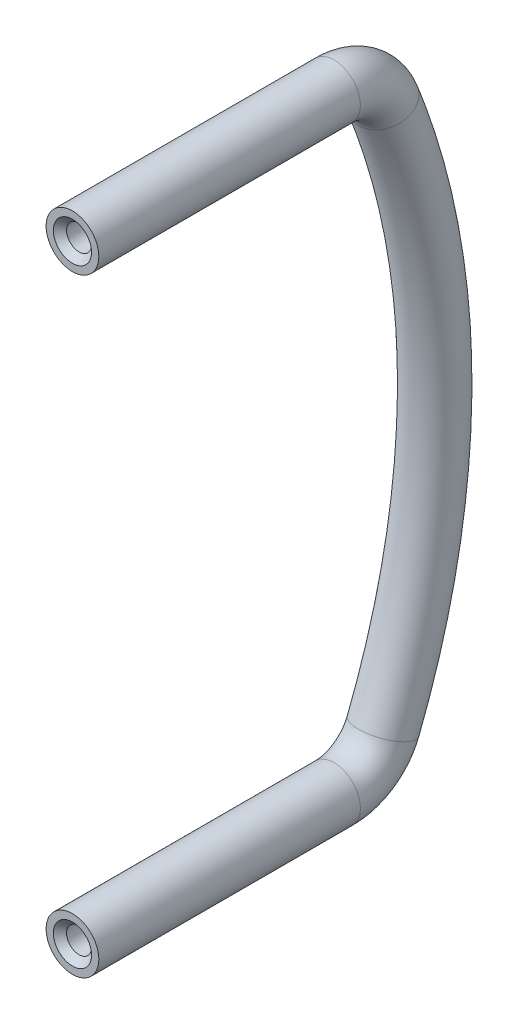
ISO-10303-21;
HEADER;
FILE_DESCRIPTION(('STEP AP214'),'2;1');
FILE_NAME('part.step','',(''),(''),'','','');
FILE_SCHEMA(('AUTOMOTIVE_DESIGN { 1 0 10303 214 1 1 1 1 }'));
ENDSEC;
DATA;
#1=APPLICATION_CONTEXT('core data for automotive mechanical design processes');
#2=APPLICATION_PROTOCOL_DEFINITION('international standard','automotive_design',2000,#1);
#3=PRODUCT_CONTEXT('',#1,'mechanical');
#4=PRODUCT('Part','Part','',(#3));
#5=PRODUCT_RELATED_PRODUCT_CATEGORY('part','',(#4));
#6=PRODUCT_DEFINITION_FORMATION('','',#4);
#7=PRODUCT_DEFINITION_CONTEXT('part definition',#1,'design');
#8=PRODUCT_DEFINITION('design','',#6,#7);
#9=PRODUCT_DEFINITION_SHAPE('','',#8);
#10=(LENGTH_UNIT() NAMED_UNIT(*) SI_UNIT(.MILLI.,.METRE.));
#11=(NAMED_UNIT(*) PLANE_ANGLE_UNIT() SI_UNIT($,.RADIAN.));
#12=(NAMED_UNIT(*) SI_UNIT($,.STERADIAN.) SOLID_ANGLE_UNIT());
#13=UNCERTAINTY_MEASURE_WITH_UNIT(LENGTH_MEASURE(1.E-05),#10,'distance_accuracy_value','');
#14=(GEOMETRIC_REPRESENTATION_CONTEXT(3) GLOBAL_UNCERTAINTY_ASSIGNED_CONTEXT((#13)) GLOBAL_UNIT_ASSIGNED_CONTEXT((#10,
#11,#12)) REPRESENTATION_CONTEXT('',''));
#15=CARTESIAN_POINT('',(0.,0.,0.));
#16=DIRECTION('',(0.,0.,1.));
#17=DIRECTION('',(1.,0.,0.));
#18=AXIS2_PLACEMENT_3D('',#15,#16,#17);
#19=CARTESIAN_POINT('',(0.,-6.3,-78.5780172444106));
#20=DIRECTION('',(0.,0.,1.));
#21=DIRECTION('',(1.,0.,0.));
#22=AXIS2_PLACEMENT_3D('',#19,#20,#21);
#23=CONICAL_SURFACE('',#22,0.94999999976153,1.04719755088572);
#24=CARTESIAN_POINT('',(-2.55795384873636E-10,-6.3,-79.1265000001147));
#25=VERTEX_POINT('',#24);
#26=VERTEX_LOOP('',#25);
#27=FACE_BOUND('',#26,.T.);
#28=CARTESIAN_POINT('',(0.,-6.3,-78.57801724427));
#29=DIRECTION('',(0.,0.,1.));
#30=DIRECTION('',(1.,0.,0.));
#31=AXIS2_PLACEMENT_3D('',#28,#29,#30);
#32=CIRCLE('',#31,0.95);
#33=CARTESIAN_POINT('',(0.95,-6.3,-78.57801724427));
#34=VERTEX_POINT('',#33);
#35=EDGE_CURVE('E37',#34,#34,#32,.T.);
#36=ORIENTED_EDGE('',*,*,#35,.T.);
#37=EDGE_LOOP('',(#36));
#38=FACE_BOUND('',#37,.T.);
#39=ADVANCED_FACE('F17',(#27,#38),#23,.F.);
#40=CARTESIAN_POINT('',(0.,-52.5,-79.1265000000863));
#41=DIRECTION('',(0.,0.,1.));
#42=DIRECTION('',(1.,0.,0.));
#43=AXIS2_PLACEMENT_3D('',#40,#41,#42);
#44=CONICAL_SURFACE('',#43,0.949999999875217,1.04719755089266);
#45=CARTESIAN_POINT('',(0.,-52.5,-79.1265));
#46=DIRECTION('',(0.,0.,1.));
#47=DIRECTION('',(1.,0.,0.));
#48=AXIS2_PLACEMENT_3D('',#45,#46,#47);
#49=CIRCLE('',#48,0.95);
#50=CARTESIAN_POINT('',(0.95,-52.5,-79.1265));
#51=VERTEX_POINT('',#50);
#52=EDGE_CURVE('E39',#51,#51,#49,.T.);
#53=ORIENTED_EDGE('',*,*,#52,.T.);
#54=EDGE_LOOP('',(#53));
#55=FACE_BOUND('',#54,.T.);
#56=CARTESIAN_POINT('',(-2.55795384873636E-10,-52.5,-79.6749827558472));
#57=VERTEX_POINT('',#56);
#58=VERTEX_LOOP('',#57);
#59=FACE_BOUND('',#58,.T.);
#60=ADVANCED_FACE('F34',(#55,#59),#44,.F.);
#61=CARTESIAN_POINT('',(0.,-6.3,-79.4265));
#62=DIRECTION('',(0.,0.,1.));
#63=DIRECTION('',(1.,0.,0.));
#64=AXIS2_PLACEMENT_3D('',#61,#62,#63);
#65=CYLINDRICAL_SURFACE('',#64,0.95);
#66=ORIENTED_EDGE('',*,*,#35,.F.);
#67=EDGE_LOOP('',(#66));
#68=FACE_BOUND('',#67,.T.);
#69=CARTESIAN_POINT('',(0.,-6.3,-73.6265000000458));
#70=DIRECTION('',(0.,0.,1.));
#71=DIRECTION('',(0.,-1.,0.));
#72=AXIS2_PLACEMENT_3D('',#69,#70,#71);
#73=CIRCLE('',#72,0.94999999999909);
#74=CARTESIAN_POINT('',(0.,-7.24999999999909,-73.6265000000458));
#75=VERTEX_POINT('',#74);
#76=EDGE_CURVE('E42',#75,#75,#73,.T.);
#77=ORIENTED_EDGE('',*,*,#76,.T.);
#78=EDGE_LOOP('',(#77));
#79=FACE_BOUND('',#78,.T.);
#80=ADVANCED_FACE('F109',(#68,#79),#65,.F.);
#81=CARTESIAN_POINT('',(0.,-52.5,-80.00240689352));
#82=DIRECTION('',(0.,0.,1.));
#83=DIRECTION('',(1.,0.,0.));
#84=AXIS2_PLACEMENT_3D('',#81,#82,#83);
#85=CYLINDRICAL_SURFACE('',#84,0.95);
#86=ORIENTED_EDGE('',*,*,#52,.F.);
#87=EDGE_LOOP('',(#86));
#88=FACE_BOUND('',#87,.T.);
#89=CARTESIAN_POINT('',(0.,-52.5,-73.6264999999889));
#90=DIRECTION('',(0.,0.,1.));
#91=DIRECTION('',(0.,-1.,0.));
#92=AXIS2_PLACEMENT_3D('',#89,#90,#91);
#93=CIRCLE('',#92,0.949999999998001);
#94=CARTESIAN_POINT('',(0.,-53.449999999998,-73.6264999999889));
#95=VERTEX_POINT('',#94);
#96=EDGE_CURVE('E57',#95,#95,#93,.T.);
#97=ORIENTED_EDGE('',*,*,#96,.T.);
#98=EDGE_LOOP('',(#97));
#99=FACE_BOUND('',#98,.T.);
#100=ADVANCED_FACE('F105',(#88,#99),#85,.F.);
#101=CARTESIAN_POINT('',(0.,-6.3,-73.1265000001144));
#102=DIRECTION('',(0.,0.,1.));
#103=DIRECTION('',(1.,0.,0.));
#104=AXIS2_PLACEMENT_3D('',#101,#102,#103);
#105=CONICAL_SURFACE('',#104,1.44999999993042,0.785398163397448);
#106=ORIENTED_EDGE('',*,*,#76,.F.);
#107=EDGE_LOOP('',(#106));
#108=FACE_BOUND('',#107,.T.);
#109=CARTESIAN_POINT('',(0.,-6.3,-73.1265000000678));
#110=DIRECTION('',(0.,0.,1.));
#111=DIRECTION('',(1.,0.,0.));
#112=AXIS2_PLACEMENT_3D('',#109,#110,#111);
#113=CIRCLE('',#112,1.44999999997708);
#114=CARTESIAN_POINT('',(1.44999999997708,-6.3,-73.1265000000678));
#115=VERTEX_POINT('',#114);
#116=EDGE_CURVE('E20',#115,#115,#113,.F.);
#117=ORIENTED_EDGE('',*,*,#116,.F.);
#118=EDGE_LOOP('',(#117));
#119=FACE_BOUND('',#118,.T.);
#120=ADVANCED_FACE('F101',(#108,#119),#105,.F.);
#121=CARTESIAN_POINT('',(0.,-52.5,-73.1265000000008));
#122=DIRECTION('',(0.,0.,1.));
#123=DIRECTION('',(1.,0.,0.));
#124=AXIS2_PLACEMENT_3D('',#121,#122,#123);
#125=CONICAL_SURFACE('',#124,1.44999999998618,0.785398163397448);
#126=ORIENTED_EDGE('',*,*,#96,.F.);
#127=EDGE_LOOP('',(#126));
#128=FACE_BOUND('',#127,.T.);
#129=CARTESIAN_POINT('',(0.,-52.5,-73.1265000000099));
#130=DIRECTION('',(0.,0.,1.));
#131=DIRECTION('',(1.,0.,0.));
#132=AXIS2_PLACEMENT_3D('',#129,#130,#131);
#133=CIRCLE('',#132,1.44999999997708);
#134=CARTESIAN_POINT('',(1.44999999997708,-52.5,-73.1265000000099));
#135=VERTEX_POINT('',#134);
#136=EDGE_CURVE('E52',#135,#135,#133,.T.);
#137=ORIENTED_EDGE('',*,*,#136,.T.);
#138=EDGE_LOOP('',(#137));
#139=FACE_BOUND('',#138,.T.);
#140=ADVANCED_FACE('F98',(#128,#139),#125,.F.);
#141=CARTESIAN_POINT('',(0.,-6.3,-73.1265));
#142=DIRECTION('',(0.,0.,1.));
#143=DIRECTION('',(1.,0.,0.));
#144=AXIS2_PLACEMENT_3D('',#141,#142,#143);
#145=PLANE('',#144);
#146=ORIENTED_EDGE('',*,*,#116,.T.);
#147=EDGE_LOOP('',(#146));
#148=FACE_BOUND('',#147,.T.);
#149=CARTESIAN_POINT('',(0.,-6.3,-73.1265));
#150=DIRECTION('',(0.,0.,1.));
#151=DIRECTION('',(1.,0.,0.));
#152=AXIS2_PLACEMENT_3D('',#149,#150,#151);
#153=CIRCLE('',#152,2.);
#154=CARTESIAN_POINT('',(2.,-6.3,-73.1265));
#155=VERTEX_POINT('',#154);
#156=EDGE_CURVE('E50',#155,#155,#153,.F.);
#157=ORIENTED_EDGE('',*,*,#156,.F.);
#158=EDGE_LOOP('',(#157));
#159=FACE_BOUND('',#158,.T.);
#160=ADVANCED_FACE('F94',(#148,#159),#145,.T.);
#161=CARTESIAN_POINT('',(0.,-52.5,-73.1265));
#162=DIRECTION('',(0.,0.,-1.));
#163=DIRECTION('',(-1.,0.,0.));
#164=AXIS2_PLACEMENT_3D('',#161,#162,#163);
#165=PLANE('',#164);
#166=ORIENTED_EDGE('',*,*,#136,.F.);
#167=EDGE_LOOP('',(#166));
#168=FACE_BOUND('',#167,.T.);
#169=CARTESIAN_POINT('',(0.,-52.5,-73.1265));
#170=DIRECTION('',(0.,0.,-1.));
#171=DIRECTION('',(-1.,0.,0.));
#172=AXIS2_PLACEMENT_3D('',#169,#170,#171);
#173=CIRCLE('',#172,2.);
#174=CARTESIAN_POINT('',(-2.,-52.5,-73.1265));
#175=VERTEX_POINT('',#174);
#176=EDGE_CURVE('E46',#175,#175,#173,.T.);
#177=ORIENTED_EDGE('',*,*,#176,.F.);
#178=EDGE_LOOP('',(#177));
#179=FACE_BOUND('',#178,.T.);
#180=ADVANCED_FACE('F90',(#168,#179),#165,.F.);
#181=CARTESIAN_POINT('',(0.,-6.3,-92.98119579504));
#182=DIRECTION('',(0.,0.,1.));
#183=DIRECTION('',(1.,0.,0.));
#184=AXIS2_PLACEMENT_3D('',#181,#182,#183);
#185=CYLINDRICAL_SURFACE('',#184,2.);
#186=ORIENTED_EDGE('',*,*,#156,.T.);
#187=EDGE_LOOP('',(#186));
#188=FACE_BOUND('',#187,.T.);
#189=CARTESIAN_POINT('',(0.,-6.3,-92.98119579504));
#190=DIRECTION('',(0.,0.,1.));
#191=DIRECTION('',(0.,1.,0.));
#192=AXIS2_PLACEMENT_3D('',#189,#190,#191);
#193=CIRCLE('',#192,2.);
#194=CARTESIAN_POINT('',(0.,-4.3,-92.98119579504));
#195=VERTEX_POINT('',#194);
#196=EDGE_CURVE('E49',#195,#195,#193,.F.);
#197=ORIENTED_EDGE('',*,*,#196,.F.);
#198=EDGE_LOOP('',(#197));
#199=FACE_BOUND('',#198,.T.);
#200=ADVANCED_FACE('F86',(#188,#199),#185,.T.);
#201=CARTESIAN_POINT('',(0.,-52.5,-73.1265));
#202=DIRECTION('',(0.,0.,-1.));
#203=DIRECTION('',(-1.,0.,0.));
#204=AXIS2_PLACEMENT_3D('',#201,#202,#203);
#205=CYLINDRICAL_SURFACE('',#204,2.);
#206=CARTESIAN_POINT('',(0.,-52.5,-92.98119579504));
#207=DIRECTION('',(0.,0.,-1.));
#208=DIRECTION('',(0.,-1.,0.));
#209=AXIS2_PLACEMENT_3D('',#206,#207,#208);
#210=CIRCLE('',#209,2.);
#211=CARTESIAN_POINT('',(0.,-54.5,-92.98119579504));
#212=VERTEX_POINT('',#211);
#213=EDGE_CURVE('E68',#212,#212,#210,.T.);
#214=ORIENTED_EDGE('',*,*,#213,.F.);
#215=EDGE_LOOP('',(#214));
#216=FACE_BOUND('',#215,.T.);
#217=ORIENTED_EDGE('',*,*,#176,.T.);
#218=EDGE_LOOP('',(#217));
#219=FACE_BOUND('',#218,.T.);
#220=ADVANCED_FACE('F81',(#216,#219),#205,.T.);
#221=CARTESIAN_POINT('',(0.,-10.3,-92.98119579504));
#222=DIRECTION('',(1.,0.,0.));
#223=DIRECTION('',(0.,-0.368292165596496,0.929710105764288));
#224=AXIS2_PLACEMENT_3D('',#221,#222,#223);
#225=TOROIDAL_SURFACE('',#224,3.99999999999999,2.);
#226=ORIENTED_EDGE('',*,*,#196,.T.);
#227=EDGE_LOOP('',(#226));
#228=FACE_BOUND('',#227,.T.);
#229=CARTESIAN_POINT('',(0.,-8.82683133761392,-96.7000362180988));
#230=DIRECTION('',(0.,0.929710105764286,0.3682921655965));
#231=DIRECTION('',(0.,0.3682921655965,-0.929710105764286));
#232=AXIS2_PLACEMENT_3D('',#229,#230,#231);
#233=CIRCLE('',#232,2.);
#234=CARTESIAN_POINT('',(0.,-8.09024700642092,-98.5594564296274));
#235=VERTEX_POINT('',#234);
#236=EDGE_CURVE('E26',#235,#235,#233,.F.);
#237=ORIENTED_EDGE('',*,*,#236,.F.);
#238=EDGE_LOOP('',(#237));
#239=FACE_BOUND('',#238,.T.);
#240=ADVANCED_FACE('F76',(#228,#239),#225,.T.);
#241=CARTESIAN_POINT('',(0.,-48.5,-92.98119579504));
#242=DIRECTION('',(1.,0.,0.));
#243=DIRECTION('',(0.,1.,0.));
#244=AXIS2_PLACEMENT_3D('',#241,#242,#243);
#245=TOROIDAL_SURFACE('',#244,4.,2.);
#246=CARTESIAN_POINT('',(0.,-49.973168662386,-96.7000362180988));
#247=DIRECTION('',(0.,0.929710105764287,-0.368292165596498));
#248=DIRECTION('',(0.,-0.368292165596498,-0.929710105764287));
#249=AXIS2_PLACEMENT_3D('',#246,#247,#248);
#250=CIRCLE('',#249,2.);
#251=CARTESIAN_POINT('',(0.,-50.709752993579,-98.5594564296274));
#252=VERTEX_POINT('',#251);
#253=EDGE_CURVE('E11',#252,#252,#250,.T.);
#254=ORIENTED_EDGE('',*,*,#253,.F.);
#255=EDGE_LOOP('',(#254));
#256=FACE_BOUND('',#255,.T.);
#257=ORIENTED_EDGE('',*,*,#213,.T.);
#258=EDGE_LOOP('',(#257));
#259=FACE_BOUND('',#258,.T.);
#260=ADVANCED_FACE('F80',(#256,#259),#245,.T.);
#261=CARTESIAN_POINT('',(0.,-29.4,-44.7655));
#262=DIRECTION('',(1.,0.,0.));
#263=DIRECTION('',(0.,0.368292165596495,0.929710105764288));
#264=AXIS2_PLACEMENT_3D('',#261,#262,#263);
#265=TOROIDAL_SURFACE('',#264,55.861,2.);
#266=ORIENTED_EDGE('',*,*,#236,.T.);
#267=EDGE_LOOP('',(#266));
#268=FACE_BOUND('',#267,.T.);
#269=ORIENTED_EDGE('',*,*,#253,.T.);
#270=EDGE_LOOP('',(#269));
#271=FACE_BOUND('',#270,.T.);
#272=ADVANCED_FACE('F117',(#268,#271),#265,.T.);
#273=CLOSED_SHELL('',(#39,#60,#80,#100,#120,#140,#160,#180,#200,#220,#240,#260,#272));
#274=MANIFOLD_SOLID_BREP('B1',#273);
#275=ADVANCED_BREP_SHAPE_REPRESENTATION('',(#18,#274),#14);
#276=SHAPE_DEFINITION_REPRESENTATION(#9,#275);
ENDSEC;
END-ISO-10303-21;
